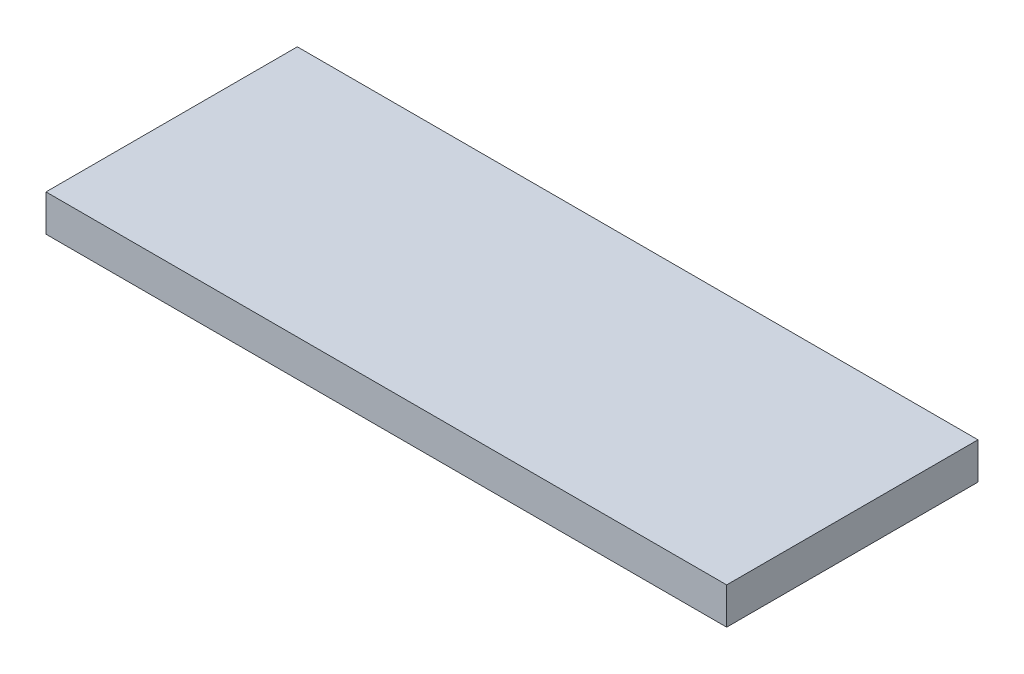
ISO-10303-21;
HEADER;
FILE_DESCRIPTION(('STEP AP214'),'2;1');
FILE_NAME('part.step','',(''),(''),'','','');
FILE_SCHEMA(('AUTOMOTIVE_DESIGN { 1 0 10303 214 1 1 1 1 }'));
ENDSEC;
DATA;
#1=APPLICATION_CONTEXT('core data for automotive mechanical design processes');
#2=APPLICATION_PROTOCOL_DEFINITION('international standard','automotive_design',2000,#1);
#3=PRODUCT_CONTEXT('',#1,'mechanical');
#4=PRODUCT('Part','Part','',(#3));
#5=PRODUCT_RELATED_PRODUCT_CATEGORY('part','',(#4));
#6=PRODUCT_DEFINITION_FORMATION('','',#4);
#7=PRODUCT_DEFINITION_CONTEXT('part definition',#1,'design');
#8=PRODUCT_DEFINITION('design','',#6,#7);
#9=PRODUCT_DEFINITION_SHAPE('','',#8);
#10=(LENGTH_UNIT() NAMED_UNIT(*) SI_UNIT(.MILLI.,.METRE.));
#11=(NAMED_UNIT(*) PLANE_ANGLE_UNIT() SI_UNIT($,.RADIAN.));
#12=(NAMED_UNIT(*) SI_UNIT($,.STERADIAN.) SOLID_ANGLE_UNIT());
#13=UNCERTAINTY_MEASURE_WITH_UNIT(LENGTH_MEASURE(1.E-05),#10,'distance_accuracy_value','');
#14=(GEOMETRIC_REPRESENTATION_CONTEXT(3) GLOBAL_UNCERTAINTY_ASSIGNED_CONTEXT((#13)) GLOBAL_UNIT_ASSIGNED_CONTEXT((#10,
#11,#12)) REPRESENTATION_CONTEXT('',''));
#15=CARTESIAN_POINT('',(0.,0.,0.));
#16=DIRECTION('',(0.,0.,1.));
#17=DIRECTION('',(1.,0.,0.));
#18=AXIS2_PLACEMENT_3D('',#15,#16,#17);
#19=CARTESIAN_POINT('',(-162.5,17.5,60.));
#20=DIRECTION('',(1.,0.,0.));
#21=DIRECTION('',(0.,0.,-1.));
#22=AXIS2_PLACEMENT_3D('',#19,#20,#21);
#23=PLANE('',#22);
#24=DIRECTION('',(0.,0.,1.));
#25=VECTOR('',#24,1.);
#26=CARTESIAN_POINT('',(-162.5,0.,60.));
#27=LINE('',#26,#25);
#28=CARTESIAN_POINT('',(-162.5,0.,-60.));
#29=VERTEX_POINT('',#28);
#30=CARTESIAN_POINT('',(-162.5,0.,60.));
#31=VERTEX_POINT('',#30);
#32=EDGE_CURVE('E97',#29,#31,#27,.T.);
#33=ORIENTED_EDGE('',*,*,#32,.T.);
#34=DIRECTION('',(0.,-1.,0.));
#35=VECTOR('',#34,1.);
#36=CARTESIAN_POINT('',(-162.5,17.5,60.));
#37=LINE('',#36,#35);
#38=CARTESIAN_POINT('',(-162.5,17.5,60.));
#39=VERTEX_POINT('',#38);
#40=EDGE_CURVE('E11',#39,#31,#37,.T.);
#41=ORIENTED_EDGE('',*,*,#40,.F.);
#42=DIRECTION('',(0.,0.,1.));
#43=VECTOR('',#42,1.);
#44=CARTESIAN_POINT('',(-162.5,17.5,60.));
#45=LINE('',#44,#43);
#46=CARTESIAN_POINT('',(-162.5,17.5,-60.));
#47=VERTEX_POINT('',#46);
#48=EDGE_CURVE('E85',#47,#39,#45,.T.);
#49=ORIENTED_EDGE('',*,*,#48,.F.);
#50=DIRECTION('',(0.,-1.,0.));
#51=VECTOR('',#50,1.);
#52=CARTESIAN_POINT('',(-162.5,17.5,-60.));
#53=LINE('',#52,#51);
#54=EDGE_CURVE('E93',#47,#29,#53,.T.);
#55=ORIENTED_EDGE('',*,*,#54,.T.);
#56=EDGE_LOOP('',(#33,#41,#49,#55));
#57=FACE_BOUND('',#56,.T.);
#58=ADVANCED_FACE('F34',(#57),#23,.F.);
#59=CARTESIAN_POINT('',(-162.5,17.5,60.));
#60=DIRECTION('',(0.,0.,-1.));
#61=DIRECTION('',(-1.,0.,0.));
#62=AXIS2_PLACEMENT_3D('',#59,#60,#61);
#63=PLANE('',#62);
#64=DIRECTION('',(1.,0.,0.));
#65=VECTOR('',#64,1.);
#66=CARTESIAN_POINT('',(-162.5,0.,60.));
#67=LINE('',#66,#65);
#68=CARTESIAN_POINT('',(162.5,0.,60.));
#69=VERTEX_POINT('',#68);
#70=EDGE_CURVE('E89',#31,#69,#67,.T.);
#71=ORIENTED_EDGE('',*,*,#70,.T.);
#72=DIRECTION('',(0.,-1.,0.));
#73=VECTOR('',#72,1.);
#74=CARTESIAN_POINT('',(162.5,17.5,60.));
#75=LINE('',#74,#73);
#76=CARTESIAN_POINT('',(162.5,17.5,60.));
#77=VERTEX_POINT('',#76);
#78=EDGE_CURVE('E42',#77,#69,#75,.T.);
#79=ORIENTED_EDGE('',*,*,#78,.F.);
#80=DIRECTION('',(1.,0.,0.));
#81=VECTOR('',#80,1.);
#82=CARTESIAN_POINT('',(-162.5,17.5,60.));
#83=LINE('',#82,#81);
#84=EDGE_CURVE('E80',#39,#77,#83,.T.);
#85=ORIENTED_EDGE('',*,*,#84,.F.);
#86=ORIENTED_EDGE('',*,*,#40,.T.);
#87=EDGE_LOOP('',(#71,#79,#85,#86));
#88=FACE_BOUND('',#87,.T.);
#89=ADVANCED_FACE('F88',(#88),#63,.F.);
#90=CARTESIAN_POINT('',(162.5,17.5,60.));
#91=DIRECTION('',(-1.,0.,0.));
#92=DIRECTION('',(0.,0.,1.));
#93=AXIS2_PLACEMENT_3D('',#90,#91,#92);
#94=PLANE('',#93);
#95=DIRECTION('',(0.,0.,-1.));
#96=VECTOR('',#95,1.);
#97=CARTESIAN_POINT('',(162.5,0.,60.));
#98=LINE('',#97,#96);
#99=CARTESIAN_POINT('',(162.5,0.,-60.));
#100=VERTEX_POINT('',#99);
#101=EDGE_CURVE('E67',#69,#100,#98,.T.);
#102=ORIENTED_EDGE('',*,*,#101,.T.);
#103=DIRECTION('',(0.,-1.,0.));
#104=VECTOR('',#103,1.);
#105=CARTESIAN_POINT('',(162.5,17.5,-60.));
#106=LINE('',#105,#104);
#107=CARTESIAN_POINT('',(162.5,17.5,-60.));
#108=VERTEX_POINT('',#107);
#109=EDGE_CURVE('E90',#108,#100,#106,.T.);
#110=ORIENTED_EDGE('',*,*,#109,.F.);
#111=DIRECTION('',(0.,0.,-1.));
#112=VECTOR('',#111,1.);
#113=CARTESIAN_POINT('',(162.5,17.5,60.));
#114=LINE('',#113,#112);
#115=EDGE_CURVE('E83',#77,#108,#114,.T.);
#116=ORIENTED_EDGE('',*,*,#115,.F.);
#117=ORIENTED_EDGE('',*,*,#78,.T.);
#118=EDGE_LOOP('',(#102,#110,#116,#117));
#119=FACE_BOUND('',#118,.T.);
#120=ADVANCED_FACE('F91',(#119),#94,.F.);
#121=CARTESIAN_POINT('',(-162.5,17.5,-60.));
#122=DIRECTION('',(0.,0.,1.));
#123=DIRECTION('',(1.,0.,0.));
#124=AXIS2_PLACEMENT_3D('',#121,#122,#123);
#125=PLANE('',#124);
#126=DIRECTION('',(-1.,0.,0.));
#127=VECTOR('',#126,1.);
#128=CARTESIAN_POINT('',(-162.5,0.,-60.));
#129=LINE('',#128,#127);
#130=EDGE_CURVE('E73',#100,#29,#129,.T.);
#131=ORIENTED_EDGE('',*,*,#130,.T.);
#132=ORIENTED_EDGE('',*,*,#54,.F.);
#133=DIRECTION('',(-1.,0.,0.));
#134=VECTOR('',#133,1.);
#135=CARTESIAN_POINT('',(-162.5,17.5,-60.));
#136=LINE('',#135,#134);
#137=EDGE_CURVE('E50',#108,#47,#136,.T.);
#138=ORIENTED_EDGE('',*,*,#137,.F.);
#139=ORIENTED_EDGE('',*,*,#109,.T.);
#140=EDGE_LOOP('',(#131,#132,#138,#139));
#141=FACE_BOUND('',#140,.T.);
#142=ADVANCED_FACE('F104',(#141),#125,.F.);
#143=CARTESIAN_POINT('',(0.,17.5,0.));
#144=DIRECTION('',(0.,-1.,0.));
#145=DIRECTION('',(0.,0.,-1.));
#146=AXIS2_PLACEMENT_3D('',#143,#144,#145);
#147=PLANE('',#146);
#148=ORIENTED_EDGE('',*,*,#48,.T.);
#149=ORIENTED_EDGE('',*,*,#84,.T.);
#150=ORIENTED_EDGE('',*,*,#115,.T.);
#151=ORIENTED_EDGE('',*,*,#137,.T.);
#152=EDGE_LOOP('',(#148,#149,#150,#151));
#153=FACE_BOUND('',#152,.T.);
#154=ADVANCED_FACE('F81',(#153),#147,.F.);
#155=CARTESIAN_POINT('',(0.,0.,0.));
#156=DIRECTION('',(0.,-1.,0.));
#157=DIRECTION('',(0.,0.,-1.));
#158=AXIS2_PLACEMENT_3D('',#155,#156,#157);
#159=PLANE('',#158);
#160=ORIENTED_EDGE('',*,*,#32,.F.);
#161=ORIENTED_EDGE('',*,*,#130,.F.);
#162=ORIENTED_EDGE('',*,*,#101,.F.);
#163=ORIENTED_EDGE('',*,*,#70,.F.);
#164=EDGE_LOOP('',(#160,#161,#162,#163));
#165=FACE_BOUND('',#164,.T.);
#166=ADVANCED_FACE('F107',(#165),#159,.T.);
#167=CLOSED_SHELL('',(#58,#89,#120,#142,#154,#166));
#168=MANIFOLD_SOLID_BREP('B2',#167);
#169=ADVANCED_BREP_SHAPE_REPRESENTATION('',(#18,#168),#14);
#170=SHAPE_DEFINITION_REPRESENTATION(#9,#169);
ENDSEC;
END-ISO-10303-21;
